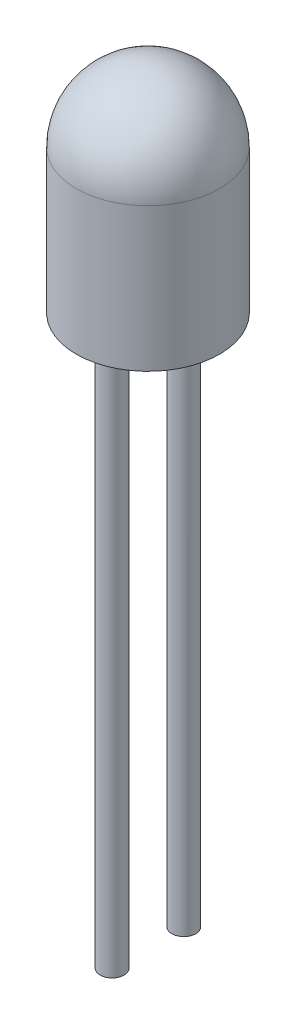
ISO-10303-21;
HEADER;
FILE_DESCRIPTION(('STEP AP214'),'2;1');
FILE_NAME('part.step','',(''),(''),'','','');
FILE_SCHEMA(('AUTOMOTIVE_DESIGN { 1 0 10303 214 1 1 1 1 }'));
ENDSEC;
DATA;
#1=APPLICATION_CONTEXT('core data for automotive mechanical design processes');
#2=APPLICATION_PROTOCOL_DEFINITION('international standard','automotive_design',2000,#1);
#3=PRODUCT_CONTEXT('',#1,'mechanical');
#4=PRODUCT('Part','Part','',(#3));
#5=PRODUCT_RELATED_PRODUCT_CATEGORY('part','',(#4));
#6=PRODUCT_DEFINITION_FORMATION('','',#4);
#7=PRODUCT_DEFINITION_CONTEXT('part definition',#1,'design');
#8=PRODUCT_DEFINITION('design','',#6,#7);
#9=PRODUCT_DEFINITION_SHAPE('','',#8);
#10=(LENGTH_UNIT() NAMED_UNIT(*) SI_UNIT(.MILLI.,.METRE.));
#11=(NAMED_UNIT(*) PLANE_ANGLE_UNIT() SI_UNIT($,.RADIAN.));
#12=(NAMED_UNIT(*) SI_UNIT($,.STERADIAN.) SOLID_ANGLE_UNIT());
#13=UNCERTAINTY_MEASURE_WITH_UNIT(LENGTH_MEASURE(1.E-05),#10,'distance_accuracy_value','');
#14=(GEOMETRIC_REPRESENTATION_CONTEXT(3) GLOBAL_UNCERTAINTY_ASSIGNED_CONTEXT((#13)) GLOBAL_UNIT_ASSIGNED_CONTEXT((#10,
#11,#12)) REPRESENTATION_CONTEXT('',''));
#15=CARTESIAN_POINT('',(0.,0.,0.));
#16=DIRECTION('',(0.,0.,1.));
#17=DIRECTION('',(1.,0.,0.));
#18=AXIS2_PLACEMENT_3D('',#15,#16,#17);
#19=CARTESIAN_POINT('',(0.,0.,0.));
#20=DIRECTION('',(0.,1.,0.));
#21=DIRECTION('',(0.,0.,1.));
#22=AXIS2_PLACEMENT_3D('',#19,#20,#21);
#23=PLANE('',#22);
#24=CARTESIAN_POINT('',(0.,0.,0.75));
#25=DIRECTION('',(0.,1.,0.));
#26=DIRECTION('',(0.,0.,1.));
#27=AXIS2_PLACEMENT_3D('',#24,#25,#26);
#28=CIRCLE('',#27,0.25);
#29=CARTESIAN_POINT('',(0.,0.,1.));
#30=VERTEX_POINT('',#29);
#31=EDGE_CURVE('E43',#30,#30,#28,.F.);
#32=ORIENTED_EDGE('',*,*,#31,.F.);
#33=EDGE_LOOP('',(#32));
#34=FACE_BOUND('',#33,.T.);
#35=CARTESIAN_POINT('',(0.,0.,0.));
#36=DIRECTION('',(0.,1.,0.));
#37=DIRECTION('',(0.,0.,1.));
#38=AXIS2_PLACEMENT_3D('',#35,#36,#37);
#39=CIRCLE('',#38,1.5);
#40=CARTESIAN_POINT('',(0.,0.,1.5));
#41=VERTEX_POINT('',#40);
#42=EDGE_CURVE('E51',#41,#41,#39,.T.);
#43=ORIENTED_EDGE('',*,*,#42,.F.);
#44=EDGE_LOOP('',(#43));
#45=FACE_BOUND('',#44,.T.);
#46=CARTESIAN_POINT('',(0.,0.,-0.75));
#47=DIRECTION('',(0.,1.,0.));
#48=DIRECTION('',(0.,0.,1.));
#49=AXIS2_PLACEMENT_3D('',#46,#47,#48);
#50=CIRCLE('',#49,0.25);
#51=CARTESIAN_POINT('',(0.,0.,-0.5));
#52=VERTEX_POINT('',#51);
#53=EDGE_CURVE('E10',#52,#52,#50,.F.);
#54=ORIENTED_EDGE('',*,*,#53,.F.);
#55=EDGE_LOOP('',(#54));
#56=FACE_BOUND('',#55,.T.);
#57=ADVANCED_FACE('F36',(#34,#45,#56),#23,.F.);
#58=CARTESIAN_POINT('',(0.,3.,0.));
#59=DIRECTION('',(0.,-1.,0.));
#60=DIRECTION('',(0.,0.,-1.));
#61=AXIS2_PLACEMENT_3D('',#58,#59,#60);
#62=CYLINDRICAL_SURFACE('',#61,1.5);
#63=CARTESIAN_POINT('',(0.,3.,0.));
#64=DIRECTION('',(0.,1.,0.));
#65=DIRECTION('',(0.,0.,1.));
#66=AXIS2_PLACEMENT_3D('',#63,#64,#65);
#67=CIRCLE('',#66,1.5);
#68=CARTESIAN_POINT('',(0.,3.,1.5));
#69=VERTEX_POINT('',#68);
#70=EDGE_CURVE('E47',#69,#69,#67,.T.);
#71=ORIENTED_EDGE('',*,*,#70,.F.);
#72=EDGE_LOOP('',(#71));
#73=FACE_BOUND('',#72,.T.);
#74=ORIENTED_EDGE('',*,*,#42,.T.);
#75=EDGE_LOOP('',(#74));
#76=FACE_BOUND('',#75,.T.);
#77=ADVANCED_FACE('F78',(#73,#76),#62,.T.);
#78=CARTESIAN_POINT('',(0.,3.,0.));
#79=DIRECTION('',(0.,0.,1.));
#80=DIRECTION('',(1.,0.,0.));
#81=AXIS2_PLACEMENT_3D('',#78,#79,#80);
#82=SPHERICAL_SURFACE('',#81,1.5);
#83=CARTESIAN_POINT('',(0.,3.,0.));
#84=DIRECTION('',(0.,1.,0.));
#85=DIRECTION('',(0.,0.,1.));
#86=AXIS2_PLACEMENT_3D('',#83,#84,#85);
#87=SPHERICAL_SURFACE('',#86,1.5);
#88=ORIENTED_EDGE('',*,*,#70,.T.);
#89=EDGE_LOOP('',(#88));
#90=FACE_BOUND('',#89,.T.);
#91=ADVANCED_FACE('F38',(#90),#87,.T.);
#92=CARTESIAN_POINT('',(0.,-11.5,0.75));
#93=DIRECTION('',(0.,1.,0.));
#94=DIRECTION('',(0.,0.,1.));
#95=AXIS2_PLACEMENT_3D('',#92,#93,#94);
#96=CYLINDRICAL_SURFACE('',#95,0.25);
#97=CARTESIAN_POINT('',(0.,-11.5,0.75));
#98=DIRECTION('',(0.,-1.,0.));
#99=DIRECTION('',(0.,0.,-1.));
#100=AXIS2_PLACEMENT_3D('',#97,#98,#99);
#101=CIRCLE('',#100,0.25);
#102=CARTESIAN_POINT('',(0.,-11.5,0.5));
#103=VERTEX_POINT('',#102);
#104=EDGE_CURVE('E56',#103,#103,#101,.T.);
#105=ORIENTED_EDGE('',*,*,#104,.F.);
#106=EDGE_LOOP('',(#105));
#107=FACE_BOUND('',#106,.T.);
#108=ORIENTED_EDGE('',*,*,#31,.T.);
#109=EDGE_LOOP('',(#108));
#110=FACE_BOUND('',#109,.T.);
#111=ADVANCED_FACE('F74',(#107,#110),#96,.T.);
#112=CARTESIAN_POINT('',(0.,-11.5,0.75));
#113=DIRECTION('',(0.,-1.,0.));
#114=DIRECTION('',(0.,0.,-1.));
#115=AXIS2_PLACEMENT_3D('',#112,#113,#114);
#116=PLANE('',#115);
#117=ORIENTED_EDGE('',*,*,#104,.T.);
#118=EDGE_LOOP('',(#117));
#119=FACE_BOUND('',#118,.T.);
#120=ADVANCED_FACE('F67',(#119),#116,.T.);
#121=CARTESIAN_POINT('',(0.,-11.5,-0.75));
#122=DIRECTION('',(0.,1.,0.));
#123=DIRECTION('',(0.,0.,1.));
#124=AXIS2_PLACEMENT_3D('',#121,#122,#123);
#125=CYLINDRICAL_SURFACE('',#124,0.25);
#126=CARTESIAN_POINT('',(0.,-11.5,-0.75));
#127=DIRECTION('',(0.,-1.,0.));
#128=DIRECTION('',(0.,0.,-1.));
#129=AXIS2_PLACEMENT_3D('',#126,#127,#128);
#130=CIRCLE('',#129,0.25);
#131=CARTESIAN_POINT('',(0.,-11.5,-1.));
#132=VERTEX_POINT('',#131);
#133=EDGE_CURVE('E59',#132,#132,#130,.T.);
#134=ORIENTED_EDGE('',*,*,#133,.F.);
#135=EDGE_LOOP('',(#134));
#136=FACE_BOUND('',#135,.T.);
#137=ORIENTED_EDGE('',*,*,#53,.T.);
#138=EDGE_LOOP('',(#137));
#139=FACE_BOUND('',#138,.T.);
#140=ADVANCED_FACE('F65',(#136,#139),#125,.T.);
#141=CARTESIAN_POINT('',(0.,-11.5,-0.75));
#142=DIRECTION('',(0.,-1.,0.));
#143=DIRECTION('',(0.,0.,-1.));
#144=AXIS2_PLACEMENT_3D('',#141,#142,#143);
#145=PLANE('',#144);
#146=ORIENTED_EDGE('',*,*,#133,.T.);
#147=EDGE_LOOP('',(#146));
#148=FACE_BOUND('',#147,.T.);
#149=ADVANCED_FACE('F63',(#148),#145,.T.);
#150=CLOSED_SHELL('',(#57,#77,#91,#111,#120,#140,#149));
#151=MANIFOLD_SOLID_BREP('B2',#150);
#152=ADVANCED_BREP_SHAPE_REPRESENTATION('',(#18,#151),#14);
#153=SHAPE_DEFINITION_REPRESENTATION(#9,#152);
ENDSEC;
END-ISO-10303-21;
